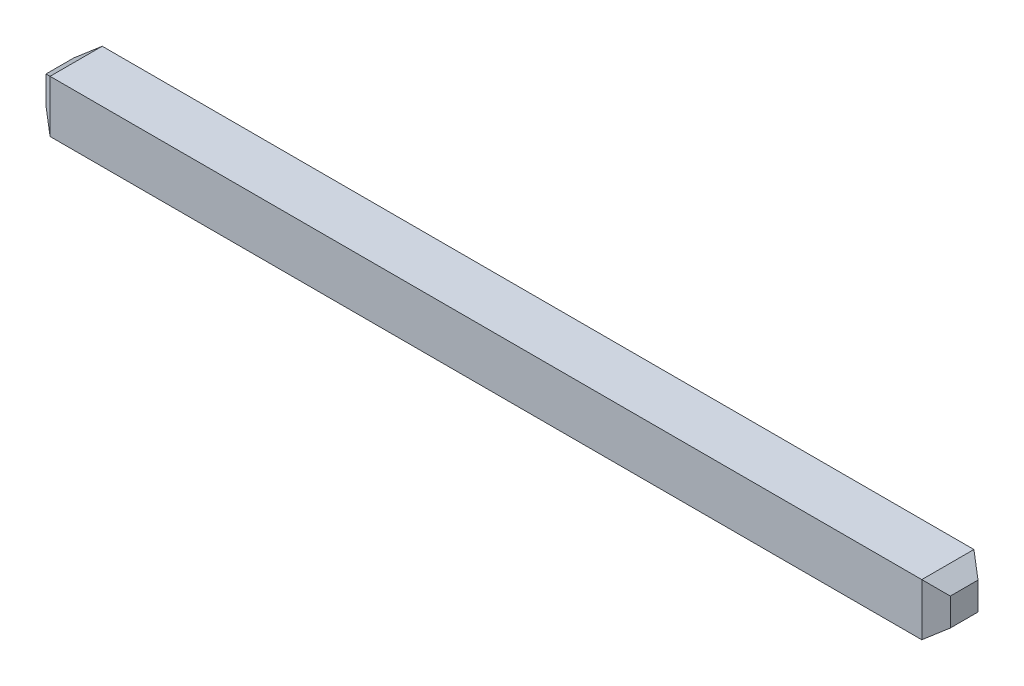
ISO-10303-21;
HEADER;
FILE_DESCRIPTION(('STEP AP214'),'2;1');
FILE_NAME('part.step','',(''),(''),'','','');
FILE_SCHEMA(('AUTOMOTIVE_DESIGN { 1 0 10303 214 1 1 1 1 }'));
ENDSEC;
DATA;
#1=APPLICATION_CONTEXT('core data for automotive mechanical design processes');
#2=APPLICATION_PROTOCOL_DEFINITION('international standard','automotive_design',2000,#1);
#3=PRODUCT_CONTEXT('',#1,'mechanical');
#4=PRODUCT('Part','Part','',(#3));
#5=PRODUCT_RELATED_PRODUCT_CATEGORY('part','',(#4));
#6=PRODUCT_DEFINITION_FORMATION('','',#4);
#7=PRODUCT_DEFINITION_CONTEXT('part definition',#1,'design');
#8=PRODUCT_DEFINITION('design','',#6,#7);
#9=PRODUCT_DEFINITION_SHAPE('','',#8);
#10=(LENGTH_UNIT() NAMED_UNIT(*) SI_UNIT(.MILLI.,.METRE.));
#11=(NAMED_UNIT(*) PLANE_ANGLE_UNIT() SI_UNIT($,.RADIAN.));
#12=(NAMED_UNIT(*) SI_UNIT($,.STERADIAN.) SOLID_ANGLE_UNIT());
#13=UNCERTAINTY_MEASURE_WITH_UNIT(LENGTH_MEASURE(1.E-05),#10,'distance_accuracy_value','');
#14=(GEOMETRIC_REPRESENTATION_CONTEXT(3) GLOBAL_UNCERTAINTY_ASSIGNED_CONTEXT((#13)) GLOBAL_UNIT_ASSIGNED_CONTEXT((#10,
#11,#12)) REPRESENTATION_CONTEXT('',''));
#15=CARTESIAN_POINT('',(0.,0.,0.));
#16=DIRECTION('',(0.,0.,1.));
#17=DIRECTION('',(1.,0.,0.));
#18=AXIS2_PLACEMENT_3D('',#15,#16,#17);
#19=CARTESIAN_POINT('',(-2.4,3.525,-24.13));
#20=DIRECTION('',(0.6,0.8,0.));
#21=DIRECTION('',(-0.8,0.6,0.));
#22=AXIS2_PLACEMENT_3D('',#19,#20,#21);
#23=PLANE('',#22);
#24=DIRECTION('',(0.,0.,1.));
#25=VECTOR('',#24,1.);
#26=CARTESIAN_POINT('',(-2.3,3.45,-24.13));
#27=LINE('',#26,#25);
#28=CARTESIAN_POINT('',(-2.29999999999978,3.45,-24.4499999999997));
#29=VERTEX_POINT('',#28);
#30=CARTESIAN_POINT('',(-2.29999999999978,3.45,-23.8100000000003));
#31=VERTEX_POINT('',#30);
#32=EDGE_CURVE('E105',#29,#31,#27,.T.);
#33=ORIENTED_EDGE('',*,*,#32,.T.);
#34=DIRECTION('',(0.685994340575954,-0.514495755427524,0.514495755419637));
#35=VECTOR('',#34,1.);
#36=CARTESIAN_POINT('',(-2.50000000000086,3.6,-23.9599999999989));
#37=LINE('',#36,#35);
#38=CARTESIAN_POINT('',(-2.50000000000022,3.6,-23.9599999999997));
#39=VERTEX_POINT('',#38);
#40=EDGE_CURVE('E92',#39,#31,#37,.T.);
#41=ORIENTED_EDGE('',*,*,#40,.F.);
#42=DIRECTION('',(0.,0.,-1.));
#43=VECTOR('',#42,1.);
#44=CARTESIAN_POINT('',(-2.5,3.6,-24.13));
#45=LINE('',#44,#43);
#46=CARTESIAN_POINT('',(-2.50000000000043,3.6,-24.3000000000006));
#47=VERTEX_POINT('',#46);
#48=EDGE_CURVE('E79',#39,#47,#45,.T.);
#49=ORIENTED_EDGE('',*,*,#48,.T.);
#50=DIRECTION('',(0.685994340575992,-0.514495755427529,-0.514495755419582));
#51=VECTOR('',#50,1.);
#52=CARTESIAN_POINT('',(-2.50000000000087,3.6,-24.3000000000012));
#53=LINE('',#52,#51);
#54=EDGE_CURVE('E20',#47,#29,#53,.T.);
#55=ORIENTED_EDGE('',*,*,#54,.T.);
#56=EDGE_LOOP('',(#33,#41,#49,#55));
#57=FACE_BOUND('',#56,.T.);
#58=ADVANCED_FACE('F17',(#57),#23,.F.);
#59=CARTESIAN_POINT('',(8.5,3.525,-24.13));
#60=DIRECTION('',(-0.6,0.8,0.));
#61=DIRECTION('',(-0.8,-0.6,0.));
#62=AXIS2_PLACEMENT_3D('',#59,#60,#61);
#63=PLANE('',#62);
#64=DIRECTION('',(0.,0.,-1.));
#65=VECTOR('',#64,1.);
#66=CARTESIAN_POINT('',(8.6,3.6,-24.13));
#67=LINE('',#66,#65);
#68=CARTESIAN_POINT('',(8.60000000000043,3.6,-23.9599999999994));
#69=VERTEX_POINT('',#68);
#70=CARTESIAN_POINT('',(8.60000000000022,3.6,-24.3000000000003));
#71=VERTEX_POINT('',#70);
#72=EDGE_CURVE('E114',#69,#71,#67,.T.);
#73=ORIENTED_EDGE('',*,*,#72,.F.);
#74=DIRECTION('',(0.685994340575954,0.514495755427524,-0.514495755419637));
#75=VECTOR('',#74,1.);
#76=CARTESIAN_POINT('',(8.39999999999914,3.45,-23.8100000000012));
#77=LINE('',#76,#75);
#78=CARTESIAN_POINT('',(8.39999999999989,3.45,-23.8100000000001));
#79=VERTEX_POINT('',#78);
#80=EDGE_CURVE('E109',#79,#69,#77,.T.);
#81=ORIENTED_EDGE('',*,*,#80,.F.);
#82=DIRECTION('',(0.,0.,1.));
#83=VECTOR('',#82,1.);
#84=CARTESIAN_POINT('',(8.4,3.45,-24.13));
#85=LINE('',#84,#83);
#86=CARTESIAN_POINT('',(8.39999999999978,3.45,-24.4499999999997));
#87=VERTEX_POINT('',#86);
#88=EDGE_CURVE('E103',#79,#87,#85,.F.);
#89=ORIENTED_EDGE('',*,*,#88,.T.);
#90=DIRECTION('',(0.685994340575992,0.514495755427534,0.514495755419576));
#91=VECTOR('',#90,1.);
#92=CARTESIAN_POINT('',(8.39999999999913,3.45,-24.4499999999988));
#93=LINE('',#92,#91);
#94=EDGE_CURVE('E107',#87,#71,#93,.T.);
#95=ORIENTED_EDGE('',*,*,#94,.T.);
#96=EDGE_LOOP('',(#73,#81,#89,#95));
#97=FACE_BOUND('',#96,.T.);
#98=ADVANCED_FACE('F175',(#97),#63,.F.);
#99=CARTESIAN_POINT('',(-2.4,3.77,-24.375));
#100=DIRECTION('',(0.599999999990736,0.,0.800000000006948));
#101=DIRECTION('',(0.800000000006948,0.,-0.599999999990736));
#102=AXIS2_PLACEMENT_3D('',#99,#100,#101);
#103=PLANE('',#102);
#104=DIRECTION('',(0.,1.,0.));
#105=VECTOR('',#104,1.);
#106=CARTESIAN_POINT('',(-2.3,3.77,-24.45));
#107=LINE('',#106,#105);
#108=CARTESIAN_POINT('',(-2.29999999999957,4.09,-24.4499999999994));
#109=VERTEX_POINT('',#108);
#110=EDGE_CURVE('E88',#109,#29,#107,.F.);
#111=ORIENTED_EDGE('',*,*,#110,.T.);
#112=ORIENTED_EDGE('',*,*,#54,.F.);
#113=DIRECTION('',(0.,1.,0.));
#114=VECTOR('',#113,1.);
#115=CARTESIAN_POINT('',(-2.5,3.77,-24.3));
#116=LINE('',#115,#114);
#117=CARTESIAN_POINT('',(-2.50000000000043,3.94,-24.3000000000006));
#118=VERTEX_POINT('',#117);
#119=EDGE_CURVE('E85',#47,#118,#116,.T.);
#120=ORIENTED_EDGE('',*,*,#119,.T.);
#121=DIRECTION('',(-0.685994340570039,-0.514495755427529,0.51449575542752));
#122=VECTOR('',#121,1.);
#123=CARTESIAN_POINT('',(-2.3,4.09,-24.45));
#124=LINE('',#123,#122);
#125=EDGE_CURVE('E126',#109,#118,#124,.T.);
#126=ORIENTED_EDGE('',*,*,#125,.F.);
#127=EDGE_LOOP('',(#111,#112,#120,#126));
#128=FACE_BOUND('',#127,.T.);
#129=ADVANCED_FACE('F84',(#128),#103,.F.);
#130=CARTESIAN_POINT('',(-2.5,3.77,-24.13));
#131=DIRECTION('',(1.,0.,0.));
#132=DIRECTION('',(0.,0.,-1.));
#133=AXIS2_PLACEMENT_3D('',#130,#131,#132);
#134=PLANE('',#133);
#135=DIRECTION('',(0.,1.,0.));
#136=VECTOR('',#135,1.);
#137=CARTESIAN_POINT('',(-2.50000000000086,3.77,-23.9599999999989));
#138=LINE('',#137,#136);
#139=CARTESIAN_POINT('',(-2.50000000000022,3.94,-23.9599999999997));
#140=VERTEX_POINT('',#139);
#141=EDGE_CURVE('E94',#140,#39,#138,.F.);
#142=ORIENTED_EDGE('',*,*,#141,.F.);
#143=DIRECTION('',(0.,0.,1.));
#144=VECTOR('',#143,1.);
#145=CARTESIAN_POINT('',(-2.5,3.94,-24.13));
#146=LINE('',#145,#144);
#147=EDGE_CURVE('E98',#118,#140,#146,.T.);
#148=ORIENTED_EDGE('',*,*,#147,.F.);
#149=ORIENTED_EDGE('',*,*,#119,.F.);
#150=ORIENTED_EDGE('',*,*,#48,.F.);
#151=EDGE_LOOP('',(#142,#148,#149,#150));
#152=FACE_BOUND('',#151,.T.);
#153=ADVANCED_FACE('F96',(#152),#134,.F.);
#154=CARTESIAN_POINT('',(-2.4,3.77,-23.885));
#155=DIRECTION('',(-0.5999999999908,0.,0.8000000000069));
#156=DIRECTION('',(0.8000000000069,0.,0.5999999999908));
#157=AXIS2_PLACEMENT_3D('',#154,#155,#156);
#158=PLANE('',#157);
#159=ORIENTED_EDGE('',*,*,#40,.T.);
#160=DIRECTION('',(0.,1.,0.));
#161=VECTOR('',#160,1.);
#162=CARTESIAN_POINT('',(-2.3,3.77,-23.81));
#163=LINE('',#162,#161);
#164=CARTESIAN_POINT('',(-2.29999999999957,4.09,-23.8100000000006));
#165=VERTEX_POINT('',#164);
#166=EDGE_CURVE('E132',#165,#31,#163,.F.);
#167=ORIENTED_EDGE('',*,*,#166,.F.);
#168=DIRECTION('',(0.68599434057003,0.514495755427522,0.514495755427537));
#169=VECTOR('',#168,1.);
#170=CARTESIAN_POINT('',(-2.5,3.94,-23.96));
#171=LINE('',#170,#169);
#172=EDGE_CURVE('E129',#140,#165,#171,.T.);
#173=ORIENTED_EDGE('',*,*,#172,.F.);
#174=ORIENTED_EDGE('',*,*,#141,.T.);
#175=EDGE_LOOP('',(#159,#167,#173,#174));
#176=FACE_BOUND('',#175,.T.);
#177=ADVANCED_FACE('F186',(#176),#158,.T.);
#178=CARTESIAN_POINT('',(3.05,3.45,-24.13));
#179=DIRECTION('',(0.,1.,0.));
#180=DIRECTION('',(0.,0.,1.));
#181=AXIS2_PLACEMENT_3D('',#178,#179,#180);
#182=PLANE('',#181);
#183=ORIENTED_EDGE('',*,*,#32,.F.);
#184=DIRECTION('',(1.,0.,0.));
#185=VECTOR('',#184,1.);
#186=CARTESIAN_POINT('',(3.05,3.45,-24.45));
#187=LINE('',#186,#185);
#188=EDGE_CURVE('E123',#29,#87,#187,.T.);
#189=ORIENTED_EDGE('',*,*,#188,.T.);
#190=ORIENTED_EDGE('',*,*,#88,.F.);
#191=DIRECTION('',(1.,0.,0.));
#192=VECTOR('',#191,1.);
#193=CARTESIAN_POINT('',(3.05,3.45,-23.81));
#194=LINE('',#193,#192);
#195=EDGE_CURVE('E135',#31,#79,#194,.T.);
#196=ORIENTED_EDGE('',*,*,#195,.F.);
#197=EDGE_LOOP('',(#183,#189,#190,#196));
#198=FACE_BOUND('',#197,.T.);
#199=ADVANCED_FACE('F179',(#198),#182,.F.);
#200=CARTESIAN_POINT('',(8.5,3.77,-24.375));
#201=DIRECTION('',(-0.599999999990736,0.,0.800000000006948));
#202=DIRECTION('',(0.800000000006948,0.,0.599999999990736));
#203=AXIS2_PLACEMENT_3D('',#200,#201,#202);
#204=PLANE('',#203);
#205=DIRECTION('',(0.,1.,0.));
#206=VECTOR('',#205,1.);
#207=CARTESIAN_POINT('',(8.6,3.77,-24.3));
#208=LINE('',#207,#206);
#209=CARTESIAN_POINT('',(8.60000000000043,3.94,-24.3000000000006));
#210=VERTEX_POINT('',#209);
#211=EDGE_CURVE('E117',#71,#210,#208,.T.);
#212=ORIENTED_EDGE('',*,*,#211,.F.);
#213=ORIENTED_EDGE('',*,*,#94,.F.);
#214=DIRECTION('',(0.,1.,0.));
#215=VECTOR('',#214,1.);
#216=CARTESIAN_POINT('',(8.4,3.77,-24.45));
#217=LINE('',#216,#215);
#218=CARTESIAN_POINT('',(8.39999999999957,4.09,-24.4499999999994));
#219=VERTEX_POINT('',#218);
#220=EDGE_CURVE('E120',#87,#219,#217,.T.);
#221=ORIENTED_EDGE('',*,*,#220,.T.);
#222=DIRECTION('',(-0.685994340570037,0.514495755427528,-0.514495755427522));
#223=VECTOR('',#222,1.);
#224=CARTESIAN_POINT('',(8.6,3.94,-24.3));
#225=LINE('',#224,#223);
#226=EDGE_CURVE('E140',#210,#219,#225,.T.);
#227=ORIENTED_EDGE('',*,*,#226,.F.);
#228=EDGE_LOOP('',(#212,#213,#221,#227));
#229=FACE_BOUND('',#228,.T.);
#230=ADVANCED_FACE('F167',(#229),#204,.F.);
#231=CARTESIAN_POINT('',(8.5,3.77,-23.885));
#232=DIRECTION('',(0.5999999999908,0.,0.8000000000069));
#233=DIRECTION('',(0.8000000000069,0.,-0.5999999999908));
#234=AXIS2_PLACEMENT_3D('',#231,#232,#233);
#235=PLANE('',#234);
#236=DIRECTION('',(0.685994340570029,-0.514495755427522,-0.51449575542754));
#237=VECTOR('',#236,1.);
#238=CARTESIAN_POINT('',(8.4,4.09,-23.81));
#239=LINE('',#238,#237);
#240=CARTESIAN_POINT('',(8.39999999999957,4.09,-23.8100000000006));
#241=VERTEX_POINT('',#240);
#242=CARTESIAN_POINT('',(8.60000000000043,3.94,-23.9599999999994));
#243=VERTEX_POINT('',#242);
#244=EDGE_CURVE('E35',#241,#243,#239,.T.);
#245=ORIENTED_EDGE('',*,*,#244,.F.);
#246=DIRECTION('',(0.,1.,0.));
#247=VECTOR('',#246,1.);
#248=CARTESIAN_POINT('',(8.4,3.77,-23.81));
#249=LINE('',#248,#247);
#250=EDGE_CURVE('E138',#79,#241,#249,.T.);
#251=ORIENTED_EDGE('',*,*,#250,.F.);
#252=ORIENTED_EDGE('',*,*,#80,.T.);
#253=DIRECTION('',(0.,1.,0.));
#254=VECTOR('',#253,1.);
#255=CARTESIAN_POINT('',(8.6,3.77,-23.96));
#256=LINE('',#255,#254);
#257=EDGE_CURVE('E111',#243,#69,#256,.F.);
#258=ORIENTED_EDGE('',*,*,#257,.F.);
#259=EDGE_LOOP('',(#245,#251,#252,#258));
#260=FACE_BOUND('',#259,.T.);
#261=ADVANCED_FACE('F211',(#260),#235,.T.);
#262=CARTESIAN_POINT('',(8.6,3.77,-24.13));
#263=DIRECTION('',(1.,0.,0.));
#264=DIRECTION('',(0.,0.,-1.));
#265=AXIS2_PLACEMENT_3D('',#262,#263,#264);
#266=PLANE('',#265);
#267=ORIENTED_EDGE('',*,*,#211,.T.);
#268=DIRECTION('',(0.,0.,1.));
#269=VECTOR('',#268,1.);
#270=CARTESIAN_POINT('',(8.6,3.94,-24.13));
#271=LINE('',#270,#269);
#272=EDGE_CURVE('E144',#243,#210,#271,.F.);
#273=ORIENTED_EDGE('',*,*,#272,.F.);
#274=ORIENTED_EDGE('',*,*,#257,.T.);
#275=ORIENTED_EDGE('',*,*,#72,.T.);
#276=EDGE_LOOP('',(#267,#273,#274,#275));
#277=FACE_BOUND('',#276,.T.);
#278=ADVANCED_FACE('F172',(#277),#266,.T.);
#279=CARTESIAN_POINT('',(3.05,3.77,-24.45));
#280=DIRECTION('',(0.,0.,1.));
#281=DIRECTION('',(1.,0.,0.));
#282=AXIS2_PLACEMENT_3D('',#279,#280,#281);
#283=PLANE('',#282);
#284=ORIENTED_EDGE('',*,*,#110,.F.);
#285=DIRECTION('',(1.,0.,0.));
#286=VECTOR('',#285,1.);
#287=CARTESIAN_POINT('',(3.05,4.09,-24.45));
#288=LINE('',#287,#286);
#289=EDGE_CURVE('E147',#219,#109,#288,.F.);
#290=ORIENTED_EDGE('',*,*,#289,.F.);
#291=ORIENTED_EDGE('',*,*,#220,.F.);
#292=ORIENTED_EDGE('',*,*,#188,.F.);
#293=EDGE_LOOP('',(#284,#290,#291,#292));
#294=FACE_BOUND('',#293,.T.);
#295=ADVANCED_FACE('F181',(#294),#283,.F.);
#296=CARTESIAN_POINT('',(-2.4,4.015,-24.13));
#297=DIRECTION('',(-0.6,0.8,0.));
#298=DIRECTION('',(-0.8,-0.6,0.));
#299=AXIS2_PLACEMENT_3D('',#296,#297,#298);
#300=PLANE('',#299);
#301=ORIENTED_EDGE('',*,*,#172,.T.);
#302=DIRECTION('',(0.,0.,1.));
#303=VECTOR('',#302,1.);
#304=CARTESIAN_POINT('',(-2.3,4.09,-24.13));
#305=LINE('',#304,#303);
#306=EDGE_CURVE('E150',#109,#165,#305,.T.);
#307=ORIENTED_EDGE('',*,*,#306,.F.);
#308=ORIENTED_EDGE('',*,*,#125,.T.);
#309=ORIENTED_EDGE('',*,*,#147,.T.);
#310=EDGE_LOOP('',(#301,#307,#308,#309));
#311=FACE_BOUND('',#310,.T.);
#312=ADVANCED_FACE('F183',(#311),#300,.T.);
#313=CARTESIAN_POINT('',(3.05,3.77,-23.81));
#314=DIRECTION('',(0.,0.,1.));
#315=DIRECTION('',(1.,0.,0.));
#316=AXIS2_PLACEMENT_3D('',#313,#314,#315);
#317=PLANE('',#316);
#318=ORIENTED_EDGE('',*,*,#195,.T.);
#319=ORIENTED_EDGE('',*,*,#250,.T.);
#320=DIRECTION('',(1.,0.,0.));
#321=VECTOR('',#320,1.);
#322=CARTESIAN_POINT('',(3.05,4.09,-23.81));
#323=LINE('',#322,#321);
#324=EDGE_CURVE('E26',#165,#241,#323,.T.);
#325=ORIENTED_EDGE('',*,*,#324,.F.);
#326=ORIENTED_EDGE('',*,*,#166,.T.);
#327=EDGE_LOOP('',(#318,#319,#325,#326));
#328=FACE_BOUND('',#327,.T.);
#329=ADVANCED_FACE('F160',(#328),#317,.T.);
#330=CARTESIAN_POINT('',(8.5,4.015,-24.13));
#331=DIRECTION('',(0.6,0.8,0.));
#332=DIRECTION('',(-0.8,0.6,0.));
#333=AXIS2_PLACEMENT_3D('',#330,#331,#332);
#334=PLANE('',#333);
#335=ORIENTED_EDGE('',*,*,#244,.T.);
#336=ORIENTED_EDGE('',*,*,#272,.T.);
#337=ORIENTED_EDGE('',*,*,#226,.T.);
#338=DIRECTION('',(0.,0.,1.));
#339=VECTOR('',#338,1.);
#340=CARTESIAN_POINT('',(8.4,4.09,-24.13));
#341=LINE('',#340,#339);
#342=EDGE_CURVE('E11',#241,#219,#341,.F.);
#343=ORIENTED_EDGE('',*,*,#342,.F.);
#344=EDGE_LOOP('',(#335,#336,#337,#343));
#345=FACE_BOUND('',#344,.T.);
#346=ADVANCED_FACE('F163',(#345),#334,.T.);
#347=CARTESIAN_POINT('',(3.05,4.09,-24.13));
#348=DIRECTION('',(0.,1.,0.));
#349=DIRECTION('',(0.,0.,1.));
#350=AXIS2_PLACEMENT_3D('',#347,#348,#349);
#351=PLANE('',#350);
#352=ORIENTED_EDGE('',*,*,#324,.T.);
#353=ORIENTED_EDGE('',*,*,#342,.T.);
#354=ORIENTED_EDGE('',*,*,#289,.T.);
#355=ORIENTED_EDGE('',*,*,#306,.T.);
#356=EDGE_LOOP('',(#352,#353,#354,#355));
#357=FACE_BOUND('',#356,.T.);
#358=ADVANCED_FACE('F156',(#357),#351,.T.);
#359=CLOSED_SHELL('',(#58,#98,#129,#153,#177,#199,#230,#261,#278,#295,#312,#329,#346,#358));
#360=MANIFOLD_SOLID_BREP('B1',#359);
#361=ADVANCED_BREP_SHAPE_REPRESENTATION('',(#18,#360),#14);
#362=SHAPE_DEFINITION_REPRESENTATION(#9,#361);
ENDSEC;
END-ISO-10303-21;
